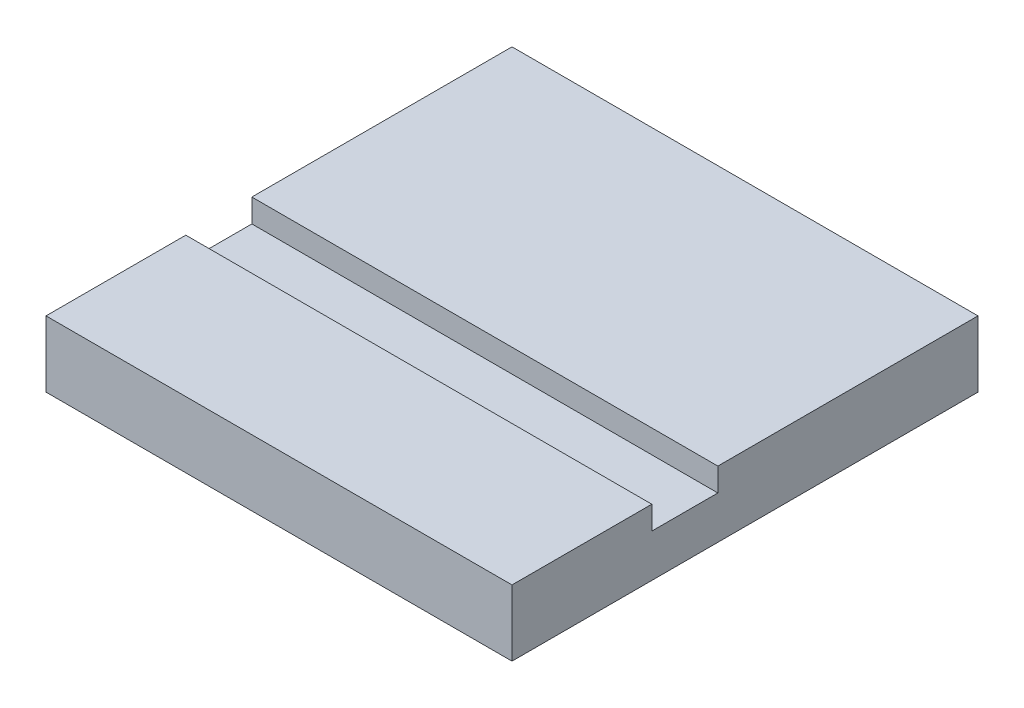
ISO-10303-21;
HEADER;
FILE_DESCRIPTION(('STEP AP214'),'2;1');
FILE_NAME('part.step','',(''),(''),'','','');
FILE_SCHEMA(('AUTOMOTIVE_DESIGN { 1 0 10303 214 1 1 1 1 }'));
ENDSEC;
DATA;
#1=APPLICATION_CONTEXT('core data for automotive mechanical design processes');
#2=APPLICATION_PROTOCOL_DEFINITION('international standard','automotive_design',2000,#1);
#3=PRODUCT_CONTEXT('',#1,'mechanical');
#4=PRODUCT('Part','Part','',(#3));
#5=PRODUCT_RELATED_PRODUCT_CATEGORY('part','',(#4));
#6=PRODUCT_DEFINITION_FORMATION('','',#4);
#7=PRODUCT_DEFINITION_CONTEXT('part definition',#1,'design');
#8=PRODUCT_DEFINITION('design','',#6,#7);
#9=PRODUCT_DEFINITION_SHAPE('','',#8);
#10=(LENGTH_UNIT() NAMED_UNIT(*) SI_UNIT(.MILLI.,.METRE.));
#11=(NAMED_UNIT(*) PLANE_ANGLE_UNIT() SI_UNIT($,.RADIAN.));
#12=(NAMED_UNIT(*) SI_UNIT($,.STERADIAN.) SOLID_ANGLE_UNIT());
#13=UNCERTAINTY_MEASURE_WITH_UNIT(LENGTH_MEASURE(1.E-05),#10,'distance_accuracy_value','');
#14=(GEOMETRIC_REPRESENTATION_CONTEXT(3) GLOBAL_UNCERTAINTY_ASSIGNED_CONTEXT((#13)) GLOBAL_UNIT_ASSIGNED_CONTEXT((#10,
#11,#12)) REPRESENTATION_CONTEXT('',''));
#15=CARTESIAN_POINT('',(0.,0.,0.));
#16=DIRECTION('',(0.,0.,1.));
#17=DIRECTION('',(1.,0.,0.));
#18=AXIS2_PLACEMENT_3D('',#15,#16,#17);
#19=CARTESIAN_POINT('',(0.,18.,0.));
#20=DIRECTION('',(0.,-1.,0.));
#21=DIRECTION('',(0.,0.,-1.));
#22=AXIS2_PLACEMENT_3D('',#19,#20,#21);
#23=PLANE('',#22);
#24=DIRECTION('',(0.,0.,1.));
#25=VECTOR('',#24,1.);
#26=CARTESIAN_POINT('',(-63.5,18.,-63.5));
#27=LINE('',#26,#25);
#28=CARTESIAN_POINT('',(-63.5,18.,-63.5));
#29=VERTEX_POINT('',#28);
#30=CARTESIAN_POINT('',(-63.5,18.,7.39999999999999));
#31=VERTEX_POINT('',#30);
#32=EDGE_CURVE('E134',#29,#31,#27,.T.);
#33=ORIENTED_EDGE('',*,*,#32,.T.);
#34=DIRECTION('',(-1.,0.,0.));
#35=VECTOR('',#34,1.);
#36=CARTESIAN_POINT('',(-63.5,18.,7.39999999999999));
#37=LINE('',#36,#35);
#38=CARTESIAN_POINT('',(63.5,18.,7.39999999999999));
#39=VERTEX_POINT('',#38);
#40=EDGE_CURVE('E125',#39,#31,#37,.T.);
#41=ORIENTED_EDGE('',*,*,#40,.F.);
#42=DIRECTION('',(0.,0.,-1.));
#43=VECTOR('',#42,1.);
#44=CARTESIAN_POINT('',(63.5,18.,-63.5));
#45=LINE('',#44,#43);
#46=CARTESIAN_POINT('',(63.5,18.,-63.5));
#47=VERTEX_POINT('',#46);
#48=EDGE_CURVE('E138',#39,#47,#45,.T.);
#49=ORIENTED_EDGE('',*,*,#48,.T.);
#50=DIRECTION('',(-1.,0.,0.));
#51=VECTOR('',#50,1.);
#52=CARTESIAN_POINT('',(63.5,18.,-63.5));
#53=LINE('',#52,#51);
#54=EDGE_CURVE('E59',#47,#29,#53,.T.);
#55=ORIENTED_EDGE('',*,*,#54,.T.);
#56=EDGE_LOOP('',(#33,#41,#49,#55));
#57=FACE_BOUND('',#56,.T.);
#58=ADVANCED_FACE('F35',(#57),#23,.F.);
#59=CARTESIAN_POINT('',(-63.5,18.,-63.5));
#60=DIRECTION('',(1.,0.,0.));
#61=DIRECTION('',(0.,0.,-1.));
#62=AXIS2_PLACEMENT_3D('',#59,#60,#61);
#63=PLANE('',#62);
#64=DIRECTION('',(0.,0.,1.));
#65=VECTOR('',#64,1.);
#66=CARTESIAN_POINT('',(-63.5,11.65,25.4));
#67=LINE('',#66,#65);
#68=CARTESIAN_POINT('',(-63.5,11.65,7.39999999999999));
#69=VERTEX_POINT('',#68);
#70=CARTESIAN_POINT('',(-63.5,11.65,25.4));
#71=VERTEX_POINT('',#70);
#72=EDGE_CURVE('E116',#69,#71,#67,.T.);
#73=ORIENTED_EDGE('',*,*,#72,.F.);
#74=DIRECTION('',(0.,1.,0.));
#75=VECTOR('',#74,1.);
#76=CARTESIAN_POINT('',(-63.5,11.65,7.39999999999999));
#77=LINE('',#76,#75);
#78=EDGE_CURVE('E148',#69,#31,#77,.T.);
#79=ORIENTED_EDGE('',*,*,#78,.T.);
#80=ORIENTED_EDGE('',*,*,#32,.F.);
#81=DIRECTION('',(0.,-1.,0.));
#82=VECTOR('',#81,1.);
#83=CARTESIAN_POINT('',(-63.5,18.,-63.5));
#84=LINE('',#83,#82);
#85=CARTESIAN_POINT('',(-63.5,0.,-63.5));
#86=VERTEX_POINT('',#85);
#87=EDGE_CURVE('E143',#29,#86,#84,.T.);
#88=ORIENTED_EDGE('',*,*,#87,.T.);
#89=DIRECTION('',(0.,0.,1.));
#90=VECTOR('',#89,1.);
#91=CARTESIAN_POINT('',(-63.5,0.,-63.5));
#92=LINE('',#91,#90);
#93=CARTESIAN_POINT('',(-63.5,0.,63.5));
#94=VERTEX_POINT('',#93);
#95=EDGE_CURVE('E144',#86,#94,#92,.T.);
#96=ORIENTED_EDGE('',*,*,#95,.T.);
#97=DIRECTION('',(0.,-1.,0.));
#98=VECTOR('',#97,1.);
#99=CARTESIAN_POINT('',(-63.5,18.,63.5));
#100=LINE('',#99,#98);
#101=CARTESIAN_POINT('',(-63.5,18.,63.5));
#102=VERTEX_POINT('',#101);
#103=EDGE_CURVE('E11',#102,#94,#100,.T.);
#104=ORIENTED_EDGE('',*,*,#103,.F.);
#105=CARTESIAN_POINT('',(-63.5,18.,25.4));
#106=VERTEX_POINT('',#105);
#107=EDGE_CURVE('E87',#106,#102,#27,.T.);
#108=ORIENTED_EDGE('',*,*,#107,.F.);
#109=DIRECTION('',(0.,1.,0.));
#110=VECTOR('',#109,1.);
#111=CARTESIAN_POINT('',(-63.5,11.65,25.4));
#112=LINE('',#111,#110);
#113=EDGE_CURVE('E50',#71,#106,#112,.T.);
#114=ORIENTED_EDGE('',*,*,#113,.F.);
#115=EDGE_LOOP('',(#73,#79,#80,#88,#96,#104,#108,#114));
#116=FACE_BOUND('',#115,.T.);
#117=ADVANCED_FACE('F37',(#116),#63,.F.);
#118=CARTESIAN_POINT('',(63.5,18.,63.5));
#119=DIRECTION('',(0.,0.,-1.));
#120=DIRECTION('',(-1.,0.,0.));
#121=AXIS2_PLACEMENT_3D('',#118,#119,#120);
#122=PLANE('',#121);
#123=DIRECTION('',(1.,0.,0.));
#124=VECTOR('',#123,1.);
#125=CARTESIAN_POINT('',(63.5,0.,63.5));
#126=LINE('',#125,#124);
#127=CARTESIAN_POINT('',(63.5,0.,63.5));
#128=VERTEX_POINT('',#127);
#129=EDGE_CURVE('E147',#94,#128,#126,.T.);
#130=ORIENTED_EDGE('',*,*,#129,.T.);
#131=DIRECTION('',(0.,-1.,0.));
#132=VECTOR('',#131,1.);
#133=CARTESIAN_POINT('',(63.5,18.,63.5));
#134=LINE('',#133,#132);
#135=CARTESIAN_POINT('',(63.5,18.,63.5));
#136=VERTEX_POINT('',#135);
#137=EDGE_CURVE('E43',#136,#128,#134,.T.);
#138=ORIENTED_EDGE('',*,*,#137,.F.);
#139=DIRECTION('',(1.,0.,0.));
#140=VECTOR('',#139,1.);
#141=CARTESIAN_POINT('',(63.5,18.,63.5));
#142=LINE('',#141,#140);
#143=EDGE_CURVE('E136',#102,#136,#142,.T.);
#144=ORIENTED_EDGE('',*,*,#143,.F.);
#145=ORIENTED_EDGE('',*,*,#103,.T.);
#146=EDGE_LOOP('',(#130,#138,#144,#145));
#147=FACE_BOUND('',#146,.T.);
#148=ADVANCED_FACE('F192',(#147),#122,.F.);
#149=CARTESIAN_POINT('',(63.5,18.,-63.5));
#150=DIRECTION('',(-1.,0.,0.));
#151=DIRECTION('',(0.,0.,1.));
#152=AXIS2_PLACEMENT_3D('',#149,#150,#151);
#153=PLANE('',#152);
#154=ORIENTED_EDGE('',*,*,#48,.F.);
#155=DIRECTION('',(0.,1.,0.));
#156=VECTOR('',#155,1.);
#157=CARTESIAN_POINT('',(63.5,11.65,7.39999999999999));
#158=LINE('',#157,#156);
#159=CARTESIAN_POINT('',(63.5,11.65,7.39999999999999));
#160=VERTEX_POINT('',#159);
#161=EDGE_CURVE('E129',#160,#39,#158,.T.);
#162=ORIENTED_EDGE('',*,*,#161,.F.);
#163=DIRECTION('',(0.,0.,-1.));
#164=VECTOR('',#163,1.);
#165=CARTESIAN_POINT('',(63.5,11.65,25.4));
#166=LINE('',#165,#164);
#167=CARTESIAN_POINT('',(63.5,11.65,25.4));
#168=VERTEX_POINT('',#167);
#169=EDGE_CURVE('E115',#168,#160,#166,.T.);
#170=ORIENTED_EDGE('',*,*,#169,.F.);
#171=DIRECTION('',(0.,1.,0.));
#172=VECTOR('',#171,1.);
#173=CARTESIAN_POINT('',(63.5,11.65,25.4));
#174=LINE('',#173,#172);
#175=CARTESIAN_POINT('',(63.5,18.,25.4));
#176=VERTEX_POINT('',#175);
#177=EDGE_CURVE('E112',#168,#176,#174,.T.);
#178=ORIENTED_EDGE('',*,*,#177,.T.);
#179=EDGE_CURVE('E139',#136,#176,#45,.T.);
#180=ORIENTED_EDGE('',*,*,#179,.F.);
#181=ORIENTED_EDGE('',*,*,#137,.T.);
#182=DIRECTION('',(0.,0.,-1.));
#183=VECTOR('',#182,1.);
#184=CARTESIAN_POINT('',(63.5,0.,-63.5));
#185=LINE('',#184,#183);
#186=CARTESIAN_POINT('',(63.5,0.,-63.5));
#187=VERTEX_POINT('',#186);
#188=EDGE_CURVE('E150',#128,#187,#185,.T.);
#189=ORIENTED_EDGE('',*,*,#188,.T.);
#190=DIRECTION('',(0.,-1.,0.));
#191=VECTOR('',#190,1.);
#192=CARTESIAN_POINT('',(63.5,18.,-63.5));
#193=LINE('',#192,#191);
#194=EDGE_CURVE('E154',#47,#187,#193,.T.);
#195=ORIENTED_EDGE('',*,*,#194,.F.);
#196=EDGE_LOOP('',(#154,#162,#170,#178,#180,#181,#189,#195));
#197=FACE_BOUND('',#196,.T.);
#198=ADVANCED_FACE('F161',(#197),#153,.F.);
#199=CARTESIAN_POINT('',(63.5,18.,-63.5));
#200=DIRECTION('',(0.,0.,1.));
#201=DIRECTION('',(1.,0.,0.));
#202=AXIS2_PLACEMENT_3D('',#199,#200,#201);
#203=PLANE('',#202);
#204=DIRECTION('',(-1.,0.,0.));
#205=VECTOR('',#204,1.);
#206=CARTESIAN_POINT('',(63.5,0.,-63.5));
#207=LINE('',#206,#205);
#208=EDGE_CURVE('E80',#187,#86,#207,.T.);
#209=ORIENTED_EDGE('',*,*,#208,.T.);
#210=ORIENTED_EDGE('',*,*,#87,.F.);
#211=ORIENTED_EDGE('',*,*,#54,.F.);
#212=ORIENTED_EDGE('',*,*,#194,.T.);
#213=EDGE_LOOP('',(#209,#210,#211,#212));
#214=FACE_BOUND('',#213,.T.);
#215=ADVANCED_FACE('F168',(#214),#203,.F.);
#216=ORIENTED_EDGE('',*,*,#179,.T.);
#217=DIRECTION('',(1.,0.,0.));
#218=VECTOR('',#217,1.);
#219=CARTESIAN_POINT('',(-63.5,18.,25.4));
#220=LINE('',#219,#218);
#221=EDGE_CURVE('E172',#106,#176,#220,.T.);
#222=ORIENTED_EDGE('',*,*,#221,.F.);
#223=ORIENTED_EDGE('',*,*,#107,.T.);
#224=ORIENTED_EDGE('',*,*,#143,.T.);
#225=EDGE_LOOP('',(#216,#222,#223,#224));
#226=FACE_BOUND('',#225,.T.);
#227=ADVANCED_FACE('F184',(#226),#23,.F.);
#228=CARTESIAN_POINT('',(0.,0.,0.));
#229=DIRECTION('',(0.,-1.,0.));
#230=DIRECTION('',(0.,0.,-1.));
#231=AXIS2_PLACEMENT_3D('',#228,#229,#230);
#232=PLANE('',#231);
#233=ORIENTED_EDGE('',*,*,#95,.F.);
#234=ORIENTED_EDGE('',*,*,#208,.F.);
#235=ORIENTED_EDGE('',*,*,#188,.F.);
#236=ORIENTED_EDGE('',*,*,#129,.F.);
#237=EDGE_LOOP('',(#233,#234,#235,#236));
#238=FACE_BOUND('',#237,.T.);
#239=ADVANCED_FACE('F166',(#238),#232,.T.);
#240=CARTESIAN_POINT('',(-63.5,11.65,7.39999999999999));
#241=DIRECTION('',(0.,0.,-1.));
#242=DIRECTION('',(-1.,0.,0.));
#243=AXIS2_PLACEMENT_3D('',#240,#241,#242);
#244=PLANE('',#243);
#245=ORIENTED_EDGE('',*,*,#40,.T.);
#246=ORIENTED_EDGE('',*,*,#78,.F.);
#247=DIRECTION('',(-1.,0.,0.));
#248=VECTOR('',#247,1.);
#249=CARTESIAN_POINT('',(-63.5,11.65,7.39999999999999));
#250=LINE('',#249,#248);
#251=EDGE_CURVE('E122',#160,#69,#250,.T.);
#252=ORIENTED_EDGE('',*,*,#251,.F.);
#253=ORIENTED_EDGE('',*,*,#161,.T.);
#254=EDGE_LOOP('',(#245,#246,#252,#253));
#255=FACE_BOUND('',#254,.T.);
#256=ADVANCED_FACE('F176',(#255),#244,.F.);
#257=CARTESIAN_POINT('',(-63.5,11.65,25.4));
#258=DIRECTION('',(0.,0.,1.));
#259=DIRECTION('',(1.,0.,0.));
#260=AXIS2_PLACEMENT_3D('',#257,#258,#259);
#261=PLANE('',#260);
#262=ORIENTED_EDGE('',*,*,#221,.T.);
#263=ORIENTED_EDGE('',*,*,#177,.F.);
#264=DIRECTION('',(1.,0.,0.));
#265=VECTOR('',#264,1.);
#266=CARTESIAN_POINT('',(-63.5,11.65,25.4));
#267=LINE('',#266,#265);
#268=EDGE_CURVE('E108',#71,#168,#267,.T.);
#269=ORIENTED_EDGE('',*,*,#268,.F.);
#270=ORIENTED_EDGE('',*,*,#113,.T.);
#271=EDGE_LOOP('',(#262,#263,#269,#270));
#272=FACE_BOUND('',#271,.T.);
#273=ADVANCED_FACE('F110',(#272),#261,.F.);
#274=CARTESIAN_POINT('',(0.,11.65,0.));
#275=DIRECTION('',(0.,-1.,0.));
#276=DIRECTION('',(0.,0.,-1.));
#277=AXIS2_PLACEMENT_3D('',#274,#275,#276);
#278=PLANE('',#277);
#279=ORIENTED_EDGE('',*,*,#72,.T.);
#280=ORIENTED_EDGE('',*,*,#268,.T.);
#281=ORIENTED_EDGE('',*,*,#169,.T.);
#282=ORIENTED_EDGE('',*,*,#251,.T.);
#283=EDGE_LOOP('',(#279,#280,#281,#282));
#284=FACE_BOUND('',#283,.T.);
#285=ADVANCED_FACE('F120',(#284),#278,.F.);
#286=CLOSED_SHELL('',(#58,#117,#148,#198,#215,#227,#239,#256,#273,#285));
#287=MANIFOLD_SOLID_BREP('B2',#286);
#288=ADVANCED_BREP_SHAPE_REPRESENTATION('',(#18,#287),#14);
#289=SHAPE_DEFINITION_REPRESENTATION(#9,#288);
ENDSEC;
END-ISO-10303-21;
